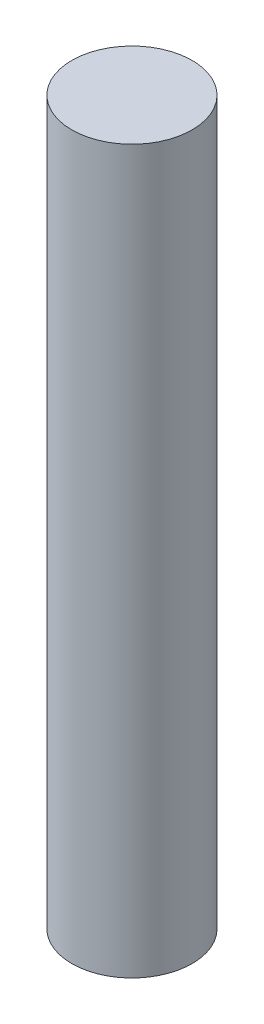
ISO-10303-21;
HEADER;
FILE_DESCRIPTION(('STEP AP214'),'2;1');
FILE_NAME('part.step','',(''),(''),'','','');
FILE_SCHEMA(('AUTOMOTIVE_DESIGN { 1 0 10303 214 1 1 1 1 }'));
ENDSEC;
DATA;
#1=APPLICATION_CONTEXT('core data for automotive mechanical design processes');
#2=APPLICATION_PROTOCOL_DEFINITION('international standard','automotive_design',2000,#1);
#3=PRODUCT_CONTEXT('',#1,'mechanical');
#4=PRODUCT('Part','Part','',(#3));
#5=PRODUCT_RELATED_PRODUCT_CATEGORY('part','',(#4));
#6=PRODUCT_DEFINITION_FORMATION('','',#4);
#7=PRODUCT_DEFINITION_CONTEXT('part definition',#1,'design');
#8=PRODUCT_DEFINITION('design','',#6,#7);
#9=PRODUCT_DEFINITION_SHAPE('','',#8);
#10=(LENGTH_UNIT() NAMED_UNIT(*) SI_UNIT(.MILLI.,.METRE.));
#11=(NAMED_UNIT(*) PLANE_ANGLE_UNIT() SI_UNIT($,.RADIAN.));
#12=(NAMED_UNIT(*) SI_UNIT($,.STERADIAN.) SOLID_ANGLE_UNIT());
#13=UNCERTAINTY_MEASURE_WITH_UNIT(LENGTH_MEASURE(1.E-05),#10,'distance_accuracy_value','');
#14=(GEOMETRIC_REPRESENTATION_CONTEXT(3) GLOBAL_UNCERTAINTY_ASSIGNED_CONTEXT((#13)) GLOBAL_UNIT_ASSIGNED_CONTEXT((#10,
#11,#12)) REPRESENTATION_CONTEXT('',''));
#15=CARTESIAN_POINT('',(0.,0.,0.));
#16=DIRECTION('',(0.,0.,1.));
#17=DIRECTION('',(1.,0.,0.));
#18=AXIS2_PLACEMENT_3D('',#15,#16,#17);
#19=CARTESIAN_POINT('',(0.,76.2,0.));
#20=DIRECTION('',(0.,-1.,0.));
#21=DIRECTION('',(0.,0.,-1.));
#22=AXIS2_PLACEMENT_3D('',#19,#20,#21);
#23=CYLINDRICAL_SURFACE('',#22,6.35);
#24=CARTESIAN_POINT('',(0.,76.2,0.));
#25=DIRECTION('',(0.,1.,0.));
#26=DIRECTION('',(0.,0.,1.));
#27=AXIS2_PLACEMENT_3D('',#24,#25,#26);
#28=CIRCLE('',#27,6.35);
#29=CARTESIAN_POINT('',(0.,76.2,6.35));
#30=VERTEX_POINT('',#29);
#31=EDGE_CURVE('E10',#30,#30,#28,.T.);
#32=ORIENTED_EDGE('',*,*,#31,.F.);
#33=EDGE_LOOP('',(#32));
#34=FACE_BOUND('',#33,.T.);
#35=CARTESIAN_POINT('',(0.,0.,0.));
#36=DIRECTION('',(0.,1.,0.));
#37=DIRECTION('',(0.,0.,1.));
#38=AXIS2_PLACEMENT_3D('',#35,#36,#37);
#39=CIRCLE('',#38,6.35);
#40=CARTESIAN_POINT('',(0.,0.,6.35));
#41=VERTEX_POINT('',#40);
#42=EDGE_CURVE('E40',#41,#41,#39,.T.);
#43=ORIENTED_EDGE('',*,*,#42,.T.);
#44=EDGE_LOOP('',(#43));
#45=FACE_BOUND('',#44,.T.);
#46=ADVANCED_FACE('F37',(#34,#45),#23,.T.);
#47=CARTESIAN_POINT('',(0.,76.2,0.));
#48=DIRECTION('',(0.,1.,0.));
#49=DIRECTION('',(0.,0.,1.));
#50=AXIS2_PLACEMENT_3D('',#47,#48,#49);
#51=PLANE('',#50);
#52=ORIENTED_EDGE('',*,*,#31,.T.);
#53=EDGE_LOOP('',(#52));
#54=FACE_BOUND('',#53,.T.);
#55=ADVANCED_FACE('F54',(#54),#51,.T.);
#56=CARTESIAN_POINT('',(0.,0.,0.));
#57=DIRECTION('',(0.,1.,0.));
#58=DIRECTION('',(0.,0.,1.));
#59=AXIS2_PLACEMENT_3D('',#56,#57,#58);
#60=PLANE('',#59);
#61=ORIENTED_EDGE('',*,*,#42,.F.);
#62=EDGE_LOOP('',(#61));
#63=FACE_BOUND('',#62,.T.);
#64=ADVANCED_FACE('F52',(#63),#60,.F.);
#65=CLOSED_SHELL('',(#46,#55,#64));
#66=MANIFOLD_SOLID_BREP('B2',#65);
#67=ADVANCED_BREP_SHAPE_REPRESENTATION('',(#18,#66),#14);
#68=SHAPE_DEFINITION_REPRESENTATION(#9,#67);
ENDSEC;
END-ISO-10303-21;
